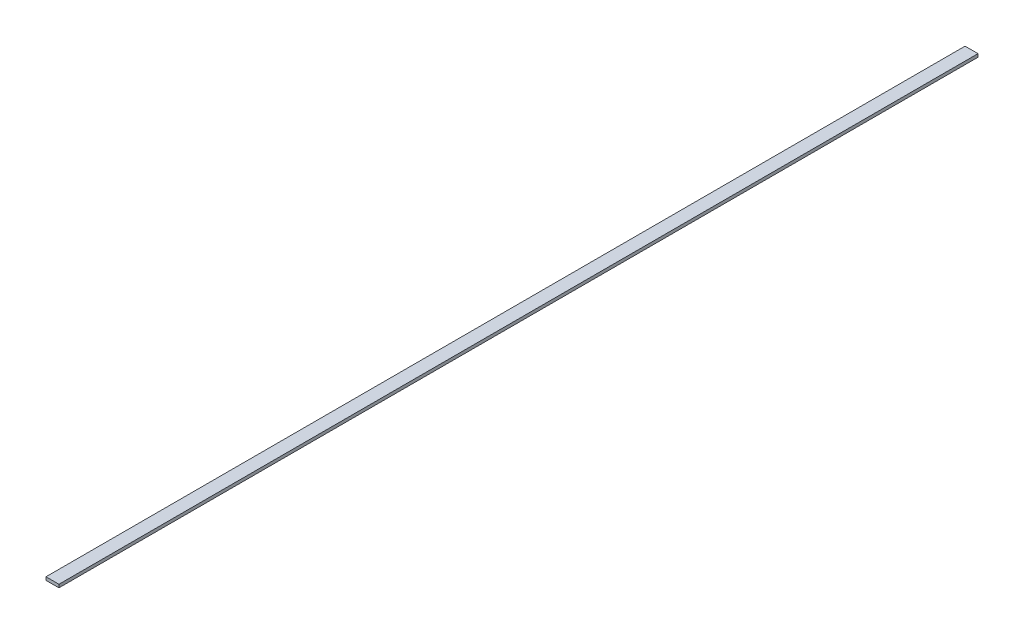
ISO-10303-21;
HEADER;
FILE_DESCRIPTION(('STEP AP214'),'2;1');
FILE_NAME('part.step','',(''),(''),'','','');
FILE_SCHEMA(('AUTOMOTIVE_DESIGN { 1 0 10303 214 1 1 1 1 }'));
ENDSEC;
DATA;
#1=APPLICATION_CONTEXT('core data for automotive mechanical design processes');
#2=APPLICATION_PROTOCOL_DEFINITION('international standard','automotive_design',2000,#1);
#3=PRODUCT_CONTEXT('',#1,'mechanical');
#4=PRODUCT('Part','Part','',(#3));
#5=PRODUCT_RELATED_PRODUCT_CATEGORY('part','',(#4));
#6=PRODUCT_DEFINITION_FORMATION('','',#4);
#7=PRODUCT_DEFINITION_CONTEXT('part definition',#1,'design');
#8=PRODUCT_DEFINITION('design','',#6,#7);
#9=PRODUCT_DEFINITION_SHAPE('','',#8);
#10=(LENGTH_UNIT() NAMED_UNIT(*) SI_UNIT(.MILLI.,.METRE.));
#11=(NAMED_UNIT(*) PLANE_ANGLE_UNIT() SI_UNIT($,.RADIAN.));
#12=(NAMED_UNIT(*) SI_UNIT($,.STERADIAN.) SOLID_ANGLE_UNIT());
#13=UNCERTAINTY_MEASURE_WITH_UNIT(LENGTH_MEASURE(1.E-05),#10,'distance_accuracy_value','');
#14=(GEOMETRIC_REPRESENTATION_CONTEXT(3) GLOBAL_UNCERTAINTY_ASSIGNED_CONTEXT((#13)) GLOBAL_UNIT_ASSIGNED_CONTEXT((#10,
#11,#12)) REPRESENTATION_CONTEXT('',''));
#15=CARTESIAN_POINT('',(0.,0.,0.));
#16=DIRECTION('',(0.,0.,1.));
#17=DIRECTION('',(1.,0.,0.));
#18=AXIS2_PLACEMENT_3D('',#15,#16,#17);
#19=CARTESIAN_POINT('',(0.,1.5,0.));
#20=DIRECTION('',(1.,0.,0.));
#21=DIRECTION('',(0.,0.,-1.));
#22=AXIS2_PLACEMENT_3D('',#19,#20,#21);
#23=PLANE('',#22);
#24=DIRECTION('',(0.,0.,1.));
#25=VECTOR('',#24,1.);
#26=CARTESIAN_POINT('',(0.,0.,0.));
#27=LINE('',#26,#25);
#28=CARTESIAN_POINT('',(0.,0.,-440.));
#29=VERTEX_POINT('',#28);
#30=CARTESIAN_POINT('',(0.,0.,0.));
#31=VERTEX_POINT('',#30);
#32=EDGE_CURVE('E109',#29,#31,#27,.T.);
#33=ORIENTED_EDGE('',*,*,#32,.T.);
#34=DIRECTION('',(0.,-1.,0.));
#35=VECTOR('',#34,1.);
#36=CARTESIAN_POINT('',(0.,1.5,0.));
#37=LINE('',#36,#35);
#38=CARTESIAN_POINT('',(0.,1.5,0.));
#39=VERTEX_POINT('',#38);
#40=EDGE_CURVE('E11',#39,#31,#37,.T.);
#41=ORIENTED_EDGE('',*,*,#40,.F.);
#42=DIRECTION('',(0.,0.,1.));
#43=VECTOR('',#42,1.);
#44=CARTESIAN_POINT('',(0.,1.5,0.));
#45=LINE('',#44,#43);
#46=CARTESIAN_POINT('',(0.,1.5,-440.));
#47=VERTEX_POINT('',#46);
#48=EDGE_CURVE('E93',#47,#39,#45,.T.);
#49=ORIENTED_EDGE('',*,*,#48,.F.);
#50=DIRECTION('',(0.,-1.,0.));
#51=VECTOR('',#50,1.);
#52=CARTESIAN_POINT('',(0.,1.5,-440.));
#53=LINE('',#52,#51);
#54=EDGE_CURVE('E105',#47,#29,#53,.T.);
#55=ORIENTED_EDGE('',*,*,#54,.T.);
#56=EDGE_LOOP('',(#33,#41,#49,#55));
#57=FACE_BOUND('',#56,.T.);
#58=ADVANCED_FACE('F40',(#57),#23,.F.);
#59=CARTESIAN_POINT('',(0.,1.5,0.));
#60=DIRECTION('',(0.,0.,-1.));
#61=DIRECTION('',(-1.,0.,0.));
#62=AXIS2_PLACEMENT_3D('',#59,#60,#61);
#63=PLANE('',#62);
#64=DIRECTION('',(1.,0.,0.));
#65=VECTOR('',#64,1.);
#66=CARTESIAN_POINT('',(0.,0.,0.));
#67=LINE('',#66,#65);
#68=CARTESIAN_POINT('',(6.2,0.,0.));
#69=VERTEX_POINT('',#68);
#70=EDGE_CURVE('E98',#31,#69,#67,.T.);
#71=ORIENTED_EDGE('',*,*,#70,.T.);
#72=DIRECTION('',(0.,-1.,0.));
#73=VECTOR('',#72,1.);
#74=CARTESIAN_POINT('',(6.2,1.5,0.));
#75=LINE('',#74,#73);
#76=CARTESIAN_POINT('',(6.2,1.5,0.));
#77=VERTEX_POINT('',#76);
#78=EDGE_CURVE('E48',#77,#69,#75,.T.);
#79=ORIENTED_EDGE('',*,*,#78,.F.);
#80=DIRECTION('',(1.,0.,0.));
#81=VECTOR('',#80,1.);
#82=CARTESIAN_POINT('',(0.,1.5,0.));
#83=LINE('',#82,#81);
#84=EDGE_CURVE('E87',#39,#77,#83,.T.);
#85=ORIENTED_EDGE('',*,*,#84,.F.);
#86=ORIENTED_EDGE('',*,*,#40,.T.);
#87=EDGE_LOOP('',(#71,#79,#85,#86));
#88=FACE_BOUND('',#87,.T.);
#89=ADVANCED_FACE('F97',(#88),#63,.F.);
#90=CARTESIAN_POINT('',(6.2,1.5,0.));
#91=DIRECTION('',(-1.,0.,0.));
#92=DIRECTION('',(0.,0.,1.));
#93=AXIS2_PLACEMENT_3D('',#90,#91,#92);
#94=PLANE('',#93);
#95=DIRECTION('',(0.,0.,-1.));
#96=VECTOR('',#95,1.);
#97=CARTESIAN_POINT('',(6.2,0.,0.));
#98=LINE('',#97,#96);
#99=CARTESIAN_POINT('',(6.2,0.,-440.));
#100=VERTEX_POINT('',#99);
#101=EDGE_CURVE('E74',#69,#100,#98,.T.);
#102=ORIENTED_EDGE('',*,*,#101,.T.);
#103=DIRECTION('',(0.,-1.,0.));
#104=VECTOR('',#103,1.);
#105=CARTESIAN_POINT('',(6.2,1.5,-440.));
#106=LINE('',#105,#104);
#107=CARTESIAN_POINT('',(6.2,1.5,-440.));
#108=VERTEX_POINT('',#107);
#109=EDGE_CURVE('E100',#108,#100,#106,.T.);
#110=ORIENTED_EDGE('',*,*,#109,.F.);
#111=DIRECTION('',(0.,0.,-1.));
#112=VECTOR('',#111,1.);
#113=CARTESIAN_POINT('',(6.2,1.5,0.));
#114=LINE('',#113,#112);
#115=EDGE_CURVE('E91',#77,#108,#114,.T.);
#116=ORIENTED_EDGE('',*,*,#115,.F.);
#117=ORIENTED_EDGE('',*,*,#78,.T.);
#118=EDGE_LOOP('',(#102,#110,#116,#117));
#119=FACE_BOUND('',#118,.T.);
#120=ADVANCED_FACE('F101',(#119),#94,.F.);
#121=CARTESIAN_POINT('',(0.,1.5,-440.));
#122=DIRECTION('',(0.,0.,1.));
#123=DIRECTION('',(1.,0.,0.));
#124=AXIS2_PLACEMENT_3D('',#121,#122,#123);
#125=PLANE('',#124);
#126=DIRECTION('',(-1.,0.,0.));
#127=VECTOR('',#126,1.);
#128=CARTESIAN_POINT('',(0.,0.,-440.));
#129=LINE('',#128,#127);
#130=EDGE_CURVE('E80',#100,#29,#129,.T.);
#131=ORIENTED_EDGE('',*,*,#130,.T.);
#132=ORIENTED_EDGE('',*,*,#54,.F.);
#133=DIRECTION('',(-1.,0.,0.));
#134=VECTOR('',#133,1.);
#135=CARTESIAN_POINT('',(0.,1.5,-440.));
#136=LINE('',#135,#134);
#137=EDGE_CURVE('E56',#108,#47,#136,.T.);
#138=ORIENTED_EDGE('',*,*,#137,.F.);
#139=ORIENTED_EDGE('',*,*,#109,.T.);
#140=EDGE_LOOP('',(#131,#132,#138,#139));
#141=FACE_BOUND('',#140,.T.);
#142=ADVANCED_FACE('F118',(#141),#125,.F.);
#143=CARTESIAN_POINT('',(0.,1.5,0.));
#144=DIRECTION('',(0.,-1.,0.));
#145=DIRECTION('',(0.,0.,-1.));
#146=AXIS2_PLACEMENT_3D('',#143,#144,#145);
#147=PLANE('',#146);
#148=ORIENTED_EDGE('',*,*,#48,.T.);
#149=ORIENTED_EDGE('',*,*,#84,.T.);
#150=ORIENTED_EDGE('',*,*,#115,.T.);
#151=ORIENTED_EDGE('',*,*,#137,.T.);
#152=EDGE_LOOP('',(#148,#149,#150,#151));
#153=FACE_BOUND('',#152,.T.);
#154=ADVANCED_FACE('F89',(#153),#147,.F.);
#155=CARTESIAN_POINT('',(0.,0.,0.));
#156=DIRECTION('',(0.,-1.,0.));
#157=DIRECTION('',(0.,0.,-1.));
#158=AXIS2_PLACEMENT_3D('',#155,#156,#157);
#159=PLANE('',#158);
#160=ORIENTED_EDGE('',*,*,#32,.F.);
#161=ORIENTED_EDGE('',*,*,#130,.F.);
#162=ORIENTED_EDGE('',*,*,#101,.F.);
#163=ORIENTED_EDGE('',*,*,#70,.F.);
#164=EDGE_LOOP('',(#160,#161,#162,#163));
#165=FACE_BOUND('',#164,.T.);
#166=ADVANCED_FACE('F121',(#165),#159,.T.);
#167=CLOSED_SHELL('',(#58,#89,#120,#142,#154,#166));
#168=MANIFOLD_SOLID_BREP('B2',#167);
#169=ADVANCED_BREP_SHAPE_REPRESENTATION('',(#18,#168),#14);
#170=SHAPE_DEFINITION_REPRESENTATION(#9,#169);
ENDSEC;
END-ISO-10303-21;
